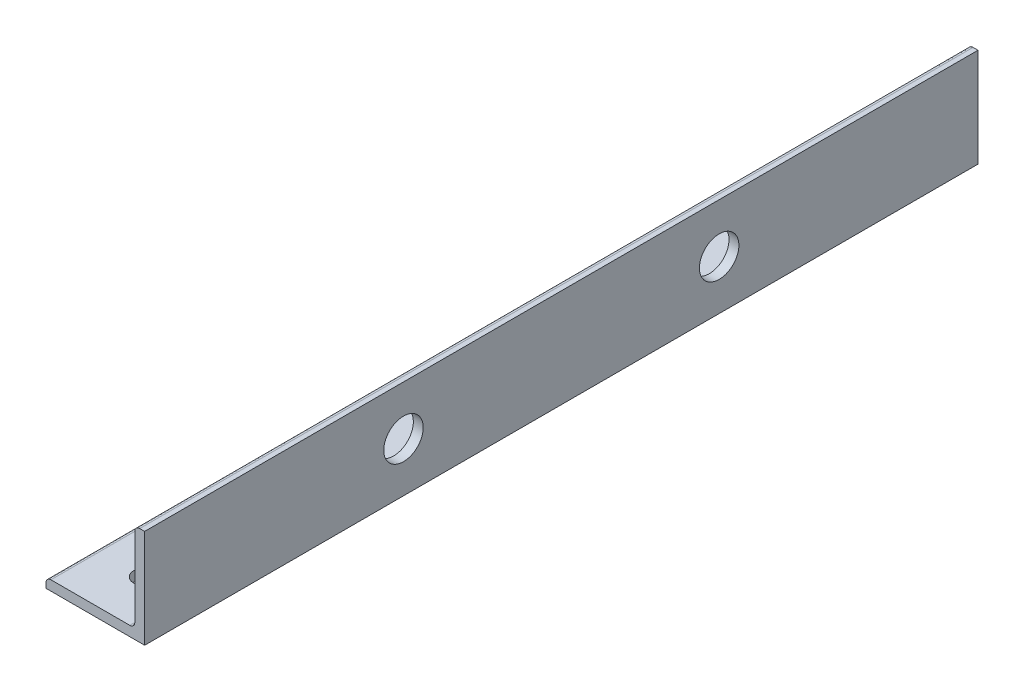
ISO-10303-21;
HEADER;
FILE_DESCRIPTION(('STEP AP214'),'2;1');
FILE_NAME('part.step','',(''),(''),'','','');
FILE_SCHEMA(('AUTOMOTIVE_DESIGN { 1 0 10303 214 1 1 1 1 }'));
ENDSEC;
DATA;
#1=APPLICATION_CONTEXT('core data for automotive mechanical design processes');
#2=APPLICATION_PROTOCOL_DEFINITION('international standard','automotive_design',2000,#1);
#3=PRODUCT_CONTEXT('',#1,'mechanical');
#4=PRODUCT('Part','Part','',(#3));
#5=PRODUCT_RELATED_PRODUCT_CATEGORY('part','',(#4));
#6=PRODUCT_DEFINITION_FORMATION('','',#4);
#7=PRODUCT_DEFINITION_CONTEXT('part definition',#1,'design');
#8=PRODUCT_DEFINITION('design','',#6,#7);
#9=PRODUCT_DEFINITION_SHAPE('','',#8);
#10=(LENGTH_UNIT() NAMED_UNIT(*) SI_UNIT(.MILLI.,.METRE.));
#11=(NAMED_UNIT(*) PLANE_ANGLE_UNIT() SI_UNIT($,.RADIAN.));
#12=(NAMED_UNIT(*) SI_UNIT($,.STERADIAN.) SOLID_ANGLE_UNIT());
#13=UNCERTAINTY_MEASURE_WITH_UNIT(LENGTH_MEASURE(1.E-05),#10,'distance_accuracy_value','');
#14=(GEOMETRIC_REPRESENTATION_CONTEXT(3) GLOBAL_UNCERTAINTY_ASSIGNED_CONTEXT((#13)) GLOBAL_UNIT_ASSIGNED_CONTEXT((#10,
#11,#12)) REPRESENTATION_CONTEXT('',''));
#15=CARTESIAN_POINT('',(0.,0.,0.));
#16=DIRECTION('',(0.,0.,1.));
#17=DIRECTION('',(1.,0.,0.));
#18=AXIS2_PLACEMENT_3D('',#15,#16,#17);
#19=CARTESIAN_POINT('',(-7.9375,0.793749999999998,67.056));
#20=DIRECTION('',(1.,0.,0.));
#21=DIRECTION('',(0.,0.,-1.));
#22=AXIS2_PLACEMENT_3D('',#19,#20,#21);
#23=PLANE('',#22);
#24=DIRECTION('',(0.,-1.,0.));
#25=VECTOR('',#24,1.);
#26=CARTESIAN_POINT('',(-7.9375,0.793749999999998,-67.056));
#27=LINE('',#26,#25);
#28=CARTESIAN_POINT('',(-7.9375,0.793749999999999,-67.056));
#29=VERTEX_POINT('',#28);
#30=CARTESIAN_POINT('',(-7.9375,0.,-67.056));
#31=VERTEX_POINT('',#30);
#32=EDGE_CURVE('E137',#29,#31,#27,.T.);
#33=ORIENTED_EDGE('',*,*,#32,.T.);
#34=DIRECTION('',(0.,0.,-1.));
#35=VECTOR('',#34,1.);
#36=CARTESIAN_POINT('',(-7.9375,0.,67.056));
#37=LINE('',#36,#35);
#38=CARTESIAN_POINT('',(-7.9375,0.,67.056));
#39=VERTEX_POINT('',#38);
#40=EDGE_CURVE('E11',#39,#31,#37,.T.);
#41=ORIENTED_EDGE('',*,*,#40,.F.);
#42=DIRECTION('',(0.,-1.,0.));
#43=VECTOR('',#42,1.);
#44=CARTESIAN_POINT('',(-7.9375,0.793749999999998,67.056));
#45=LINE('',#44,#43);
#46=CARTESIAN_POINT('',(-7.9375,0.793749999999999,67.056));
#47=VERTEX_POINT('',#46);
#48=EDGE_CURVE('E154',#47,#39,#45,.T.);
#49=ORIENTED_EDGE('',*,*,#48,.F.);
#50=DIRECTION('',(0.,0.,-1.));
#51=VECTOR('',#50,1.);
#52=CARTESIAN_POINT('',(-7.9375,0.793749999999999,67.056));
#53=LINE('',#52,#51);
#54=EDGE_CURVE('E133',#47,#29,#53,.T.);
#55=ORIENTED_EDGE('',*,*,#54,.T.);
#56=EDGE_LOOP('',(#33,#41,#49,#55));
#57=FACE_BOUND('',#56,.T.);
#58=ADVANCED_FACE('F33',(#57),#23,.F.);
#59=CARTESIAN_POINT('',(-7.9375,0.,67.056));
#60=DIRECTION('',(0.,1.,0.));
#61=DIRECTION('',(0.,0.,1.));
#62=AXIS2_PLACEMENT_3D('',#59,#60,#61);
#63=PLANE('',#62);
#64=CARTESIAN_POINT('',(0.,0.,59.1185));
#65=DIRECTION('',(0.,-1.,0.));
#66=DIRECTION('',(0.,0.,-1.));
#67=AXIS2_PLACEMENT_3D('',#64,#65,#66);
#68=CIRCLE('',#67,1.7500092);
#69=CARTESIAN_POINT('',(0.,0.,57.3684908));
#70=VERTEX_POINT('',#69);
#71=EDGE_CURVE('E176',#70,#70,#68,.T.);
#72=ORIENTED_EDGE('',*,*,#71,.F.);
#73=EDGE_LOOP('',(#72));
#74=FACE_BOUND('',#73,.T.);
#75=CARTESIAN_POINT('',(0.,0.,-59.1185));
#76=DIRECTION('',(0.,-1.,0.));
#77=DIRECTION('',(0.,0.,-1.));
#78=AXIS2_PLACEMENT_3D('',#75,#76,#77);
#79=CIRCLE('',#78,1.7500092);
#80=CARTESIAN_POINT('',(0.,0.,-60.8685092));
#81=VERTEX_POINT('',#80);
#82=EDGE_CURVE('E182',#81,#81,#79,.T.);
#83=ORIENTED_EDGE('',*,*,#82,.F.);
#84=EDGE_LOOP('',(#83));
#85=FACE_BOUND('',#84,.T.);
#86=DIRECTION('',(1.,0.,0.));
#87=VECTOR('',#86,1.);
#88=CARTESIAN_POINT('',(-7.9375,0.,-67.056));
#89=LINE('',#88,#87);
#90=CARTESIAN_POINT('',(7.9375,0.,-67.056));
#91=VERTEX_POINT('',#90);
#92=EDGE_CURVE('E140',#31,#91,#89,.T.);
#93=ORIENTED_EDGE('',*,*,#92,.T.);
#94=DIRECTION('',(0.,0.,-1.));
#95=VECTOR('',#94,1.);
#96=CARTESIAN_POINT('',(7.9375,0.,67.056));
#97=LINE('',#96,#95);
#98=CARTESIAN_POINT('',(7.9375,0.,67.056));
#99=VERTEX_POINT('',#98);
#100=EDGE_CURVE('E42',#99,#91,#97,.T.);
#101=ORIENTED_EDGE('',*,*,#100,.F.);
#102=DIRECTION('',(1.,0.,0.));
#103=VECTOR('',#102,1.);
#104=CARTESIAN_POINT('',(-7.9375,0.,67.056));
#105=LINE('',#104,#103);
#106=EDGE_CURVE('E97',#39,#99,#105,.T.);
#107=ORIENTED_EDGE('',*,*,#106,.F.);
#108=ORIENTED_EDGE('',*,*,#40,.T.);
#109=EDGE_LOOP('',(#93,#101,#107,#108));
#110=FACE_BOUND('',#109,.T.);
#111=ADVANCED_FACE('F229',(#74,#85,#110),#63,.F.);
#112=CARTESIAN_POINT('',(7.9375,0.,67.056));
#113=DIRECTION('',(-1.,0.,0.));
#114=DIRECTION('',(0.,0.,1.));
#115=AXIS2_PLACEMENT_3D('',#112,#113,#114);
#116=PLANE('',#115);
#117=CARTESIAN_POINT('',(7.9375,7.93749999999999,25.4));
#118=DIRECTION('',(1.,0.,0.));
#119=DIRECTION('',(0.,0.,-1.));
#120=AXIS2_PLACEMENT_3D('',#117,#118,#119);
#121=CIRCLE('',#120,3.175);
#122=CARTESIAN_POINT('',(7.9375,7.93749999999999,22.225));
#123=VERTEX_POINT('',#122);
#124=EDGE_CURVE('E172',#123,#123,#121,.T.);
#125=ORIENTED_EDGE('',*,*,#124,.F.);
#126=EDGE_LOOP('',(#125));
#127=FACE_BOUND('',#126,.T.);
#128=CARTESIAN_POINT('',(7.9375,7.93749999999999,-25.4));
#129=DIRECTION('',(1.,0.,0.));
#130=DIRECTION('',(0.,0.,-1.));
#131=AXIS2_PLACEMENT_3D('',#128,#129,#130);
#132=CIRCLE('',#131,3.175);
#133=CARTESIAN_POINT('',(7.9375,7.93749999999999,-28.575));
#134=VERTEX_POINT('',#133);
#135=EDGE_CURVE('E180',#134,#134,#132,.T.);
#136=ORIENTED_EDGE('',*,*,#135,.F.);
#137=EDGE_LOOP('',(#136));
#138=FACE_BOUND('',#137,.T.);
#139=DIRECTION('',(0.,1.,0.));
#140=VECTOR('',#139,1.);
#141=CARTESIAN_POINT('',(7.9375,0.,-67.056));
#142=LINE('',#141,#140);
#143=CARTESIAN_POINT('',(7.9375,15.875,-67.056));
#144=VERTEX_POINT('',#143);
#145=EDGE_CURVE('E143',#91,#144,#142,.T.);
#146=ORIENTED_EDGE('',*,*,#145,.T.);
#147=DIRECTION('',(0.,0.,-1.));
#148=VECTOR('',#147,1.);
#149=CARTESIAN_POINT('',(7.9375,15.875,67.056));
#150=LINE('',#149,#148);
#151=CARTESIAN_POINT('',(7.9375,15.875,67.056));
#152=VERTEX_POINT('',#151);
#153=EDGE_CURVE('E164',#152,#144,#150,.T.);
#154=ORIENTED_EDGE('',*,*,#153,.F.);
#155=DIRECTION('',(0.,1.,0.));
#156=VECTOR('',#155,1.);
#157=CARTESIAN_POINT('',(7.9375,0.,67.056));
#158=LINE('',#157,#156);
#159=EDGE_CURVE('E195',#99,#152,#158,.T.);
#160=ORIENTED_EDGE('',*,*,#159,.F.);
#161=ORIENTED_EDGE('',*,*,#100,.T.);
#162=EDGE_LOOP('',(#146,#154,#160,#161));
#163=FACE_BOUND('',#162,.T.);
#164=ADVANCED_FACE('F233',(#127,#138,#163),#116,.F.);
#165=CARTESIAN_POINT('',(7.14375,15.875,67.056));
#166=DIRECTION('',(0.,-1.,0.));
#167=DIRECTION('',(1.,0.,0.));
#168=AXIS2_PLACEMENT_3D('',#165,#166,#167);
#169=PLANE('',#168);
#170=DIRECTION('',(-1.,0.,0.));
#171=VECTOR('',#170,1.);
#172=CARTESIAN_POINT('',(7.14375,15.875,-67.056));
#173=LINE('',#172,#171);
#174=CARTESIAN_POINT('',(7.14375,15.875,-67.056));
#175=VERTEX_POINT('',#174);
#176=EDGE_CURVE('E145',#144,#175,#173,.T.);
#177=ORIENTED_EDGE('',*,*,#176,.T.);
#178=DIRECTION('',(0.,0.,-1.));
#179=VECTOR('',#178,1.);
#180=CARTESIAN_POINT('',(7.14375,15.875,67.056));
#181=LINE('',#180,#179);
#182=CARTESIAN_POINT('',(7.14375,15.875,67.056));
#183=VERTEX_POINT('',#182);
#184=EDGE_CURVE('E161',#183,#175,#181,.T.);
#185=ORIENTED_EDGE('',*,*,#184,.F.);
#186=DIRECTION('',(-1.,0.,0.));
#187=VECTOR('',#186,1.);
#188=CARTESIAN_POINT('',(7.14375,15.875,67.056));
#189=LINE('',#188,#187);
#190=EDGE_CURVE('E197',#152,#183,#189,.T.);
#191=ORIENTED_EDGE('',*,*,#190,.F.);
#192=ORIENTED_EDGE('',*,*,#153,.T.);
#193=EDGE_LOOP('',(#177,#185,#191,#192));
#194=FACE_BOUND('',#193,.T.);
#195=ADVANCED_FACE('F238',(#194),#169,.F.);
#196=CARTESIAN_POINT('',(7.14375,15.08125,67.056));
#197=DIRECTION('',(0.,0.,-1.));
#198=DIRECTION('',(-1.,0.,0.));
#199=AXIS2_PLACEMENT_3D('',#196,#197,#198);
#200=CYLINDRICAL_SURFACE('',#199,0.793749999999998);
#201=CARTESIAN_POINT('',(7.14375,15.08125,-67.056));
#202=DIRECTION('',(0.,0.,1.));
#203=DIRECTION('',(-1.,0.,0.));
#204=AXIS2_PLACEMENT_3D('',#201,#202,#203);
#205=CIRCLE('',#204,0.793749999999998);
#206=CARTESIAN_POINT('',(6.35,15.08125,-67.056));
#207=VERTEX_POINT('',#206);
#208=EDGE_CURVE('E147',#175,#207,#205,.T.);
#209=ORIENTED_EDGE('',*,*,#208,.T.);
#210=DIRECTION('',(0.,0.,-1.));
#211=VECTOR('',#210,1.);
#212=CARTESIAN_POINT('',(6.35,15.08125,67.056));
#213=LINE('',#212,#211);
#214=CARTESIAN_POINT('',(6.35,15.08125,67.056));
#215=VERTEX_POINT('',#214);
#216=EDGE_CURVE('E158',#215,#207,#213,.T.);
#217=ORIENTED_EDGE('',*,*,#216,.F.);
#218=CARTESIAN_POINT('',(7.14375,15.08125,67.056));
#219=DIRECTION('',(0.,0.,1.));
#220=DIRECTION('',(-1.,0.,0.));
#221=AXIS2_PLACEMENT_3D('',#218,#219,#220);
#222=CIRCLE('',#221,0.793749999999998);
#223=EDGE_CURVE('E199',#183,#215,#222,.T.);
#224=ORIENTED_EDGE('',*,*,#223,.F.);
#225=ORIENTED_EDGE('',*,*,#184,.T.);
#226=EDGE_LOOP('',(#209,#217,#224,#225));
#227=FACE_BOUND('',#226,.T.);
#228=ADVANCED_FACE('F205',(#227),#200,.T.);
#229=CARTESIAN_POINT('',(6.35,15.08125,67.056));
#230=DIRECTION('',(1.,0.,0.));
#231=DIRECTION('',(0.,1.,0.));
#232=AXIS2_PLACEMENT_3D('',#229,#230,#231);
#233=PLANE('',#232);
#234=CARTESIAN_POINT('',(6.35,7.93749999999999,25.4));
#235=DIRECTION('',(1.,0.,0.));
#236=DIRECTION('',(0.,1.,0.));
#237=AXIS2_PLACEMENT_3D('',#234,#235,#236);
#238=CIRCLE('',#237,3.175);
#239=CARTESIAN_POINT('',(6.35,11.1125,25.4));
#240=VERTEX_POINT('',#239);
#241=EDGE_CURVE('E141',#240,#240,#238,.T.);
#242=ORIENTED_EDGE('',*,*,#241,.T.);
#243=EDGE_LOOP('',(#242));
#244=FACE_BOUND('',#243,.T.);
#245=CARTESIAN_POINT('',(6.35,7.93749999999999,-25.4));
#246=DIRECTION('',(1.,0.,0.));
#247=DIRECTION('',(0.,1.,0.));
#248=AXIS2_PLACEMENT_3D('',#245,#246,#247);
#249=CIRCLE('',#248,3.175);
#250=CARTESIAN_POINT('',(6.35,11.1125,-25.4));
#251=VERTEX_POINT('',#250);
#252=EDGE_CURVE('E169',#251,#251,#249,.T.);
#253=ORIENTED_EDGE('',*,*,#252,.T.);
#254=EDGE_LOOP('',(#253));
#255=FACE_BOUND('',#254,.T.);
#256=DIRECTION('',(0.,-1.,0.));
#257=VECTOR('',#256,1.);
#258=CARTESIAN_POINT('',(6.35,15.08125,-67.056));
#259=LINE('',#258,#257);
#260=CARTESIAN_POINT('',(6.35,2.38124999999999,-67.056));
#261=VERTEX_POINT('',#260);
#262=EDGE_CURVE('E149',#207,#261,#259,.T.);
#263=ORIENTED_EDGE('',*,*,#262,.T.);
#264=DIRECTION('',(0.,0.,-1.));
#265=VECTOR('',#264,1.);
#266=CARTESIAN_POINT('',(6.35,2.38124999999999,67.056));
#267=LINE('',#266,#265);
#268=CARTESIAN_POINT('',(6.35,2.38124999999999,67.056));
#269=VERTEX_POINT('',#268);
#270=EDGE_CURVE('E128',#269,#261,#267,.T.);
#271=ORIENTED_EDGE('',*,*,#270,.F.);
#272=DIRECTION('',(0.,-1.,0.));
#273=VECTOR('',#272,1.);
#274=CARTESIAN_POINT('',(6.35,15.08125,67.056));
#275=LINE('',#274,#273);
#276=EDGE_CURVE('E119',#215,#269,#275,.T.);
#277=ORIENTED_EDGE('',*,*,#276,.F.);
#278=ORIENTED_EDGE('',*,*,#216,.T.);
#279=EDGE_LOOP('',(#263,#271,#277,#278));
#280=FACE_BOUND('',#279,.T.);
#281=ADVANCED_FACE('F209',(#244,#255,#280),#233,.F.);
#282=CARTESIAN_POINT('',(5.55625000000001,2.38124999999999,67.056));
#283=DIRECTION('',(0.,0.,-1.));
#284=DIRECTION('',(-1.,0.,0.));
#285=AXIS2_PLACEMENT_3D('',#282,#283,#284);
#286=CYLINDRICAL_SURFACE('',#285,0.793749999999998);
#287=CARTESIAN_POINT('',(5.55625000000001,2.38124999999999,-67.056));
#288=DIRECTION('',(0.,0.,-1.));
#289=DIRECTION('',(-1.,0.,0.));
#290=AXIS2_PLACEMENT_3D('',#287,#288,#289);
#291=CIRCLE('',#290,0.793749999999998);
#292=CARTESIAN_POINT('',(5.55625000000001,1.5875,-67.056));
#293=VERTEX_POINT('',#292);
#294=EDGE_CURVE('E127',#261,#293,#291,.T.);
#295=ORIENTED_EDGE('',*,*,#294,.T.);
#296=DIRECTION('',(0.,0.,-1.));
#297=VECTOR('',#296,1.);
#298=CARTESIAN_POINT('',(5.55625000000001,1.5875,67.056));
#299=LINE('',#298,#297);
#300=CARTESIAN_POINT('',(5.55625000000001,1.5875,67.056));
#301=VERTEX_POINT('',#300);
#302=EDGE_CURVE('E124',#301,#293,#299,.T.);
#303=ORIENTED_EDGE('',*,*,#302,.F.);
#304=CARTESIAN_POINT('',(5.55625000000001,2.38124999999999,67.056));
#305=DIRECTION('',(0.,0.,-1.));
#306=DIRECTION('',(-1.,0.,0.));
#307=AXIS2_PLACEMENT_3D('',#304,#305,#306);
#308=CIRCLE('',#307,0.793749999999998);
#309=EDGE_CURVE('E113',#269,#301,#308,.T.);
#310=ORIENTED_EDGE('',*,*,#309,.F.);
#311=ORIENTED_EDGE('',*,*,#270,.T.);
#312=EDGE_LOOP('',(#295,#303,#310,#311));
#313=FACE_BOUND('',#312,.T.);
#314=ADVANCED_FACE('F125',(#313),#286,.F.);
#315=CARTESIAN_POINT('',(5.55625000000001,1.5875,67.056));
#316=DIRECTION('',(0.,-1.,0.));
#317=DIRECTION('',(1.,0.,0.));
#318=AXIS2_PLACEMENT_3D('',#315,#316,#317);
#319=PLANE('',#318);
#320=CARTESIAN_POINT('',(0.,1.5875,59.1185));
#321=DIRECTION('',(0.,-1.,0.));
#322=DIRECTION('',(1.,0.,0.));
#323=AXIS2_PLACEMENT_3D('',#320,#321,#322);
#324=CIRCLE('',#323,1.7500092);
#325=CARTESIAN_POINT('',(1.7500092,1.5875,59.1185));
#326=VERTEX_POINT('',#325);
#327=EDGE_CURVE('E36',#326,#326,#324,.T.);
#328=ORIENTED_EDGE('',*,*,#327,.T.);
#329=EDGE_LOOP('',(#328));
#330=FACE_BOUND('',#329,.T.);
#331=CARTESIAN_POINT('',(0.,1.5875,-59.1185));
#332=DIRECTION('',(0.,-1.,0.));
#333=DIRECTION('',(1.,0.,0.));
#334=AXIS2_PLACEMENT_3D('',#331,#332,#333);
#335=CIRCLE('',#334,1.7500092);
#336=CARTESIAN_POINT('',(1.7500092,1.5875,-59.1185));
#337=VERTEX_POINT('',#336);
#338=EDGE_CURVE('E174',#337,#337,#335,.T.);
#339=ORIENTED_EDGE('',*,*,#338,.T.);
#340=EDGE_LOOP('',(#339));
#341=FACE_BOUND('',#340,.T.);
#342=DIRECTION('',(-1.,0.,0.));
#343=VECTOR('',#342,1.);
#344=CARTESIAN_POINT('',(5.55625000000001,1.5875,-67.056));
#345=LINE('',#344,#343);
#346=CARTESIAN_POINT('',(-7.14375,1.5875,-67.056));
#347=VERTEX_POINT('',#346);
#348=EDGE_CURVE('E83',#293,#347,#345,.T.);
#349=ORIENTED_EDGE('',*,*,#348,.T.);
#350=DIRECTION('',(0.,0.,-1.));
#351=VECTOR('',#350,1.);
#352=CARTESIAN_POINT('',(-7.14375,1.5875,67.056));
#353=LINE('',#352,#351);
#354=CARTESIAN_POINT('',(-7.14375,1.5875,67.056));
#355=VERTEX_POINT('',#354);
#356=EDGE_CURVE('E129',#355,#347,#353,.T.);
#357=ORIENTED_EDGE('',*,*,#356,.F.);
#358=DIRECTION('',(-1.,0.,0.));
#359=VECTOR('',#358,1.);
#360=CARTESIAN_POINT('',(5.55625000000001,1.5875,67.056));
#361=LINE('',#360,#359);
#362=EDGE_CURVE('E117',#301,#355,#361,.T.);
#363=ORIENTED_EDGE('',*,*,#362,.F.);
#364=ORIENTED_EDGE('',*,*,#302,.T.);
#365=EDGE_LOOP('',(#349,#357,#363,#364));
#366=FACE_BOUND('',#365,.T.);
#367=ADVANCED_FACE('F131',(#330,#341,#366),#319,.F.);
#368=CARTESIAN_POINT('',(-7.14375,0.793749999999999,67.056));
#369=DIRECTION('',(0.,0.,-1.));
#370=DIRECTION('',(-1.,0.,0.));
#371=AXIS2_PLACEMENT_3D('',#368,#369,#370);
#372=CYLINDRICAL_SURFACE('',#371,0.793749999999999);
#373=CARTESIAN_POINT('',(-7.14375,0.793749999999999,-67.056));
#374=DIRECTION('',(0.,0.,1.));
#375=DIRECTION('',(-1.,0.,0.));
#376=AXIS2_PLACEMENT_3D('',#373,#374,#375);
#377=CIRCLE('',#376,0.793749999999999);
#378=EDGE_CURVE('E89',#347,#29,#377,.T.);
#379=ORIENTED_EDGE('',*,*,#378,.T.);
#380=ORIENTED_EDGE('',*,*,#54,.F.);
#381=CARTESIAN_POINT('',(-7.14375,0.793749999999999,67.056));
#382=DIRECTION('',(0.,0.,1.));
#383=DIRECTION('',(-1.,0.,0.));
#384=AXIS2_PLACEMENT_3D('',#381,#382,#383);
#385=CIRCLE('',#384,0.793749999999999);
#386=EDGE_CURVE('E51',#355,#47,#385,.T.);
#387=ORIENTED_EDGE('',*,*,#386,.F.);
#388=ORIENTED_EDGE('',*,*,#356,.T.);
#389=EDGE_LOOP('',(#379,#380,#387,#388));
#390=FACE_BOUND('',#389,.T.);
#391=ADVANCED_FACE('F217',(#390),#372,.T.);
#392=CARTESIAN_POINT('',(7.14375,15.08125,67.056));
#393=DIRECTION('',(0.,0.,-1.));
#394=DIRECTION('',(-1.,0.,0.));
#395=AXIS2_PLACEMENT_3D('',#392,#393,#394);
#396=PLANE('',#395);
#397=ORIENTED_EDGE('',*,*,#48,.T.);
#398=ORIENTED_EDGE('',*,*,#106,.T.);
#399=ORIENTED_EDGE('',*,*,#159,.T.);
#400=ORIENTED_EDGE('',*,*,#190,.T.);
#401=ORIENTED_EDGE('',*,*,#223,.T.);
#402=ORIENTED_EDGE('',*,*,#276,.T.);
#403=ORIENTED_EDGE('',*,*,#309,.T.);
#404=ORIENTED_EDGE('',*,*,#362,.T.);
#405=ORIENTED_EDGE('',*,*,#386,.T.);
#406=EDGE_LOOP('',(#397,#398,#399,#400,#401,#402,#403,#404,#405));
#407=FACE_BOUND('',#406,.T.);
#408=ADVANCED_FACE('F115',(#407),#396,.F.);
#409=CARTESIAN_POINT('',(7.14375,15.08125,-67.056));
#410=DIRECTION('',(0.,0.,-1.));
#411=DIRECTION('',(-1.,0.,0.));
#412=AXIS2_PLACEMENT_3D('',#409,#410,#411);
#413=PLANE('',#412);
#414=ORIENTED_EDGE('',*,*,#32,.F.);
#415=ORIENTED_EDGE('',*,*,#378,.F.);
#416=ORIENTED_EDGE('',*,*,#348,.F.);
#417=ORIENTED_EDGE('',*,*,#294,.F.);
#418=ORIENTED_EDGE('',*,*,#262,.F.);
#419=ORIENTED_EDGE('',*,*,#208,.F.);
#420=ORIENTED_EDGE('',*,*,#176,.F.);
#421=ORIENTED_EDGE('',*,*,#145,.F.);
#422=ORIENTED_EDGE('',*,*,#92,.F.);
#423=EDGE_LOOP('',(#414,#415,#416,#417,#418,#419,#420,#421,#422));
#424=FACE_BOUND('',#423,.T.);
#425=ADVANCED_FACE('F212',(#424),#413,.T.);
#426=CARTESIAN_POINT('',(-7.9375,7.93749999999999,-25.4));
#427=DIRECTION('',(1.,0.,0.));
#428=DIRECTION('',(0.,0.,-1.));
#429=AXIS2_PLACEMENT_3D('',#426,#427,#428);
#430=CYLINDRICAL_SURFACE('',#429,3.175);
#431=ORIENTED_EDGE('',*,*,#135,.T.);
#432=EDGE_LOOP('',(#431));
#433=FACE_BOUND('',#432,.T.);
#434=ORIENTED_EDGE('',*,*,#252,.F.);
#435=EDGE_LOOP('',(#434));
#436=FACE_BOUND('',#435,.T.);
#437=ADVANCED_FACE('F294',(#433,#436),#430,.F.);
#438=CARTESIAN_POINT('',(-7.9375,7.93749999999999,25.4));
#439=DIRECTION('',(1.,0.,0.));
#440=DIRECTION('',(0.,0.,-1.));
#441=AXIS2_PLACEMENT_3D('',#438,#439,#440);
#442=CYLINDRICAL_SURFACE('',#441,3.175);
#443=ORIENTED_EDGE('',*,*,#124,.T.);
#444=EDGE_LOOP('',(#443));
#445=FACE_BOUND('',#444,.T.);
#446=ORIENTED_EDGE('',*,*,#241,.F.);
#447=EDGE_LOOP('',(#446));
#448=FACE_BOUND('',#447,.T.);
#449=ADVANCED_FACE('F276',(#445,#448),#442,.F.);
#450=CARTESIAN_POINT('',(0.,15.875,-59.1185));
#451=DIRECTION('',(0.,-1.,0.));
#452=DIRECTION('',(0.,0.,-1.));
#453=AXIS2_PLACEMENT_3D('',#450,#451,#452);
#454=CYLINDRICAL_SURFACE('',#453,1.7500092);
#455=ORIENTED_EDGE('',*,*,#82,.T.);
#456=EDGE_LOOP('',(#455));
#457=FACE_BOUND('',#456,.T.);
#458=ORIENTED_EDGE('',*,*,#338,.F.);
#459=EDGE_LOOP('',(#458));
#460=FACE_BOUND('',#459,.T.);
#461=ADVANCED_FACE('F270',(#457,#460),#454,.F.);
#462=CARTESIAN_POINT('',(0.,15.875,59.1185));
#463=DIRECTION('',(0.,-1.,0.));
#464=DIRECTION('',(0.,0.,-1.));
#465=AXIS2_PLACEMENT_3D('',#462,#463,#464);
#466=CYLINDRICAL_SURFACE('',#465,1.7500092);
#467=ORIENTED_EDGE('',*,*,#71,.T.);
#468=EDGE_LOOP('',(#467));
#469=FACE_BOUND('',#468,.T.);
#470=ORIENTED_EDGE('',*,*,#327,.F.);
#471=EDGE_LOOP('',(#470));
#472=FACE_BOUND('',#471,.T.);
#473=ADVANCED_FACE('F275',(#469,#472),#466,.F.);
#474=CLOSED_SHELL('',(#58,#111,#164,#195,#228,#281,#314,#367,#391,#408,#425,#437,#449,#461,#473));
#475=MANIFOLD_SOLID_BREP('B2',#474);
#476=ADVANCED_BREP_SHAPE_REPRESENTATION('',(#18,#475),#14);
#477=SHAPE_DEFINITION_REPRESENTATION(#9,#476);
ENDSEC;
END-ISO-10303-21;
